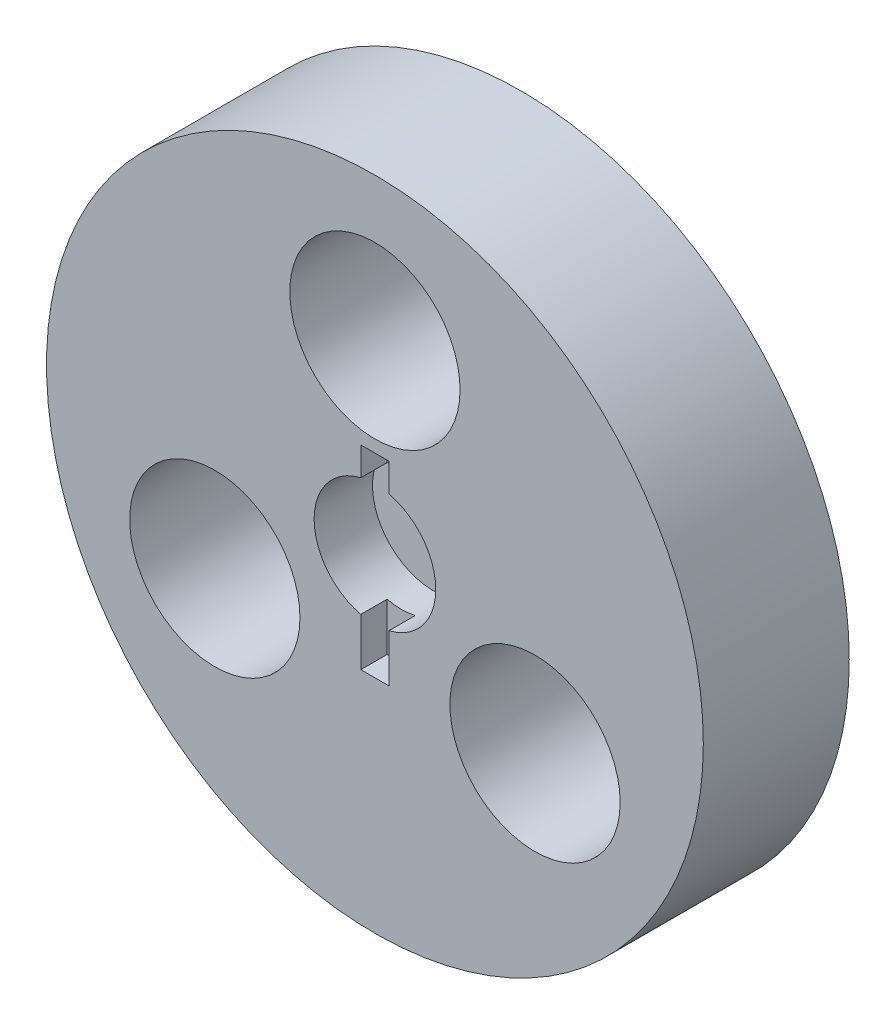
ISO-10303-21;
HEADER;
FILE_DESCRIPTION(('STEP AP214'),'2;1');
FILE_NAME('part.step','',(''),(''),'','','');
FILE_SCHEMA(('AUTOMOTIVE_DESIGN { 1 0 10303 214 1 1 1 1 }'));
ENDSEC;
DATA;
#1=APPLICATION_CONTEXT('core data for automotive mechanical design processes');
#2=APPLICATION_PROTOCOL_DEFINITION('international standard','automotive_design',2000,#1);
#3=PRODUCT_CONTEXT('',#1,'mechanical');
#4=PRODUCT('Part','Part','',(#3));
#5=PRODUCT_RELATED_PRODUCT_CATEGORY('part','',(#4));
#6=PRODUCT_DEFINITION_FORMATION('','',#4);
#7=PRODUCT_DEFINITION_CONTEXT('part definition',#1,'design');
#8=PRODUCT_DEFINITION('design','',#6,#7);
#9=PRODUCT_DEFINITION_SHAPE('','',#8);
#10=(LENGTH_UNIT() NAMED_UNIT(*) SI_UNIT(.MILLI.,.METRE.));
#11=(NAMED_UNIT(*) PLANE_ANGLE_UNIT() SI_UNIT($,.RADIAN.));
#12=(NAMED_UNIT(*) SI_UNIT($,.STERADIAN.) SOLID_ANGLE_UNIT());
#13=UNCERTAINTY_MEASURE_WITH_UNIT(LENGTH_MEASURE(1.E-05),#10,'distance_accuracy_value','');
#14=(GEOMETRIC_REPRESENTATION_CONTEXT(3) GLOBAL_UNCERTAINTY_ASSIGNED_CONTEXT((#13)) GLOBAL_UNIT_ASSIGNED_CONTEXT((#10,
#11,#12)) REPRESENTATION_CONTEXT('',''));
#15=CARTESIAN_POINT('',(0.,0.,0.));
#16=DIRECTION('',(0.,0.,1.));
#17=DIRECTION('',(1.,0.,0.));
#18=AXIS2_PLACEMENT_3D('',#15,#16,#17);
#19=CARTESIAN_POINT('',(0.,24.13,9.525));
#20=DIRECTION('',(0.,0.,-1.));
#21=DIRECTION('',(-1.,0.,0.));
#22=AXIS2_PLACEMENT_3D('',#19,#20,#21);
#23=CYLINDRICAL_SURFACE('',#22,11.1125);
#24=CARTESIAN_POINT('',(0.,24.13,9.525));
#25=DIRECTION('',(0.,0.,1.));
#26=DIRECTION('',(1.,0.,0.));
#27=AXIS2_PLACEMENT_3D('',#24,#25,#26);
#28=CIRCLE('',#27,11.1125);
#29=CARTESIAN_POINT('',(11.1125,24.13,9.525));
#30=VERTEX_POINT('',#29);
#31=EDGE_CURVE('E158',#30,#30,#28,.T.);
#32=ORIENTED_EDGE('',*,*,#31,.T.);
#33=EDGE_LOOP('',(#32));
#34=FACE_BOUND('',#33,.T.);
#35=CARTESIAN_POINT('',(0.,24.13,-9.525));
#36=DIRECTION('',(0.,0.,1.));
#37=DIRECTION('',(1.,0.,0.));
#38=AXIS2_PLACEMENT_3D('',#35,#36,#37);
#39=CIRCLE('',#38,11.1125);
#40=CARTESIAN_POINT('',(11.1125,24.13,-9.525));
#41=VERTEX_POINT('',#40);
#42=EDGE_CURVE('E169',#41,#41,#39,.T.);
#43=ORIENTED_EDGE('',*,*,#42,.F.);
#44=EDGE_LOOP('',(#43));
#45=FACE_BOUND('',#44,.T.);
#46=ADVANCED_FACE('F35',(#34,#45),#23,.F.);
#47=CARTESIAN_POINT('',(-20.8971929933185,-12.065,9.525));
#48=DIRECTION('',(0.,0.,-1.));
#49=DIRECTION('',(-1.,0.,0.));
#50=AXIS2_PLACEMENT_3D('',#47,#48,#49);
#51=CYLINDRICAL_SURFACE('',#50,11.1125);
#52=CARTESIAN_POINT('',(-20.8971929933185,-12.065,9.525));
#53=DIRECTION('',(0.,0.,1.));
#54=DIRECTION('',(1.,0.,0.));
#55=AXIS2_PLACEMENT_3D('',#52,#53,#54);
#56=CIRCLE('',#55,11.1125);
#57=CARTESIAN_POINT('',(-9.78469299331853,-12.065,9.525));
#58=VERTEX_POINT('',#57);
#59=EDGE_CURVE('E154',#58,#58,#56,.T.);
#60=ORIENTED_EDGE('',*,*,#59,.T.);
#61=EDGE_LOOP('',(#60));
#62=FACE_BOUND('',#61,.T.);
#63=CARTESIAN_POINT('',(-20.8971929933185,-12.065,-9.525));
#64=DIRECTION('',(0.,0.,1.));
#65=DIRECTION('',(1.,0.,0.));
#66=AXIS2_PLACEMENT_3D('',#63,#64,#65);
#67=CIRCLE('',#66,11.1125);
#68=CARTESIAN_POINT('',(-9.78469299331853,-12.065,-9.525));
#69=VERTEX_POINT('',#68);
#70=EDGE_CURVE('E166',#69,#69,#67,.T.);
#71=ORIENTED_EDGE('',*,*,#70,.F.);
#72=EDGE_LOOP('',(#71));
#73=FACE_BOUND('',#72,.T.);
#74=ADVANCED_FACE('F220',(#62,#73),#51,.F.);
#75=CARTESIAN_POINT('',(20.8971929933185,-12.0649999999999,9.525));
#76=DIRECTION('',(0.,0.,-1.));
#77=DIRECTION('',(-1.,0.,0.));
#78=AXIS2_PLACEMENT_3D('',#75,#76,#77);
#79=CYLINDRICAL_SURFACE('',#78,11.1125);
#80=CARTESIAN_POINT('',(20.8971929933185,-12.0649999999999,9.525));
#81=DIRECTION('',(0.,0.,1.));
#82=DIRECTION('',(1.,0.,0.));
#83=AXIS2_PLACEMENT_3D('',#80,#81,#82);
#84=CIRCLE('',#83,11.1125);
#85=CARTESIAN_POINT('',(32.0096929933185,-12.0649999999999,9.525));
#86=VERTEX_POINT('',#85);
#87=EDGE_CURVE('E151',#86,#86,#84,.T.);
#88=ORIENTED_EDGE('',*,*,#87,.T.);
#89=EDGE_LOOP('',(#88));
#90=FACE_BOUND('',#89,.T.);
#91=CARTESIAN_POINT('',(20.8971929933185,-12.0649999999999,-9.525));
#92=DIRECTION('',(0.,0.,1.));
#93=DIRECTION('',(1.,0.,0.));
#94=AXIS2_PLACEMENT_3D('',#91,#92,#93);
#95=CIRCLE('',#94,11.1125);
#96=CARTESIAN_POINT('',(32.0096929933185,-12.0649999999999,-9.525));
#97=VERTEX_POINT('',#96);
#98=EDGE_CURVE('E147',#97,#97,#95,.T.);
#99=ORIENTED_EDGE('',*,*,#98,.F.);
#100=EDGE_LOOP('',(#99));
#101=FACE_BOUND('',#100,.T.);
#102=ADVANCED_FACE('F37',(#90,#101),#79,.F.);
#103=CARTESIAN_POINT('',(0.,0.,9.525));
#104=DIRECTION('',(0.,0.,-1.));
#105=DIRECTION('',(-1.,0.,0.));
#106=AXIS2_PLACEMENT_3D('',#103,#104,#105);
#107=CYLINDRICAL_SURFACE('',#106,42.8625);
#108=CARTESIAN_POINT('',(0.,0.,9.525));
#109=DIRECTION('',(0.,0.,1.));
#110=DIRECTION('',(1.,0.,0.));
#111=AXIS2_PLACEMENT_3D('',#108,#109,#110);
#112=CIRCLE('',#111,42.8625);
#113=CARTESIAN_POINT('',(42.8625,0.,9.525));
#114=VERTEX_POINT('',#113);
#115=EDGE_CURVE('E161',#114,#114,#112,.T.);
#116=ORIENTED_EDGE('',*,*,#115,.F.);
#117=EDGE_LOOP('',(#116));
#118=FACE_BOUND('',#117,.T.);
#119=CARTESIAN_POINT('',(0.,0.,-9.525));
#120=DIRECTION('',(0.,0.,1.));
#121=DIRECTION('',(1.,0.,0.));
#122=AXIS2_PLACEMENT_3D('',#119,#120,#121);
#123=CIRCLE('',#122,42.8625);
#124=CARTESIAN_POINT('',(42.8625,0.,-9.525));
#125=VERTEX_POINT('',#124);
#126=EDGE_CURVE('E155',#125,#125,#123,.T.);
#127=ORIENTED_EDGE('',*,*,#126,.T.);
#128=EDGE_LOOP('',(#127));
#129=FACE_BOUND('',#128,.T.);
#130=ADVANCED_FACE('F229',(#118,#129),#107,.T.);
#131=CARTESIAN_POINT('',(0.,0.,9.525));
#132=DIRECTION('',(0.,0.,1.));
#133=DIRECTION('',(1.,0.,0.));
#134=AXIS2_PLACEMENT_3D('',#131,#132,#133);
#135=PLANE('',#134);
#136=DIRECTION('',(0.,1.,0.));
#137=VECTOR('',#136,1.);
#138=CARTESIAN_POINT('',(1.8415,11.43,9.525));
#139=LINE('',#138,#137);
#140=CARTESIAN_POINT('',(1.8415,-13.97,9.525));
#141=VERTEX_POINT('',#140);
#142=CARTESIAN_POINT('',(1.8415,-7.7209315500139,9.525));
#143=VERTEX_POINT('',#142);
#144=EDGE_CURVE('E128',#141,#143,#139,.T.);
#145=ORIENTED_EDGE('',*,*,#144,.F.);
#146=DIRECTION('',(1.,0.,0.));
#147=VECTOR('',#146,1.);
#148=CARTESIAN_POINT('',(1.8415,-13.97,9.525));
#149=LINE('',#148,#147);
#150=CARTESIAN_POINT('',(-1.8415,-13.97,9.525));
#151=VERTEX_POINT('',#150);
#152=EDGE_CURVE('E109',#151,#141,#149,.T.);
#153=ORIENTED_EDGE('',*,*,#152,.F.);
#154=DIRECTION('',(0.,-1.,0.));
#155=VECTOR('',#154,1.);
#156=CARTESIAN_POINT('',(-1.8415,11.43,9.525));
#157=LINE('',#156,#155);
#158=CARTESIAN_POINT('',(-1.8415,-7.7209315500139,9.525));
#159=VERTEX_POINT('',#158);
#160=EDGE_CURVE('E132',#159,#151,#157,.T.);
#161=ORIENTED_EDGE('',*,*,#160,.F.);
#162=CARTESIAN_POINT('',(0.,0.,9.525));
#163=DIRECTION('',(0.,0.,1.));
#164=DIRECTION('',(1.,0.,0.));
#165=AXIS2_PLACEMENT_3D('',#162,#163,#164);
#166=CIRCLE('',#165,7.9375);
#167=CARTESIAN_POINT('',(-1.8415,7.7209315500139,9.525));
#168=VERTEX_POINT('',#167);
#169=EDGE_CURVE('E148',#168,#159,#166,.T.);
#170=ORIENTED_EDGE('',*,*,#169,.F.);
#171=CARTESIAN_POINT('',(-1.8415,11.43,9.525));
#172=VERTEX_POINT('',#171);
#173=EDGE_CURVE('E133',#172,#168,#157,.T.);
#174=ORIENTED_EDGE('',*,*,#173,.F.);
#175=DIRECTION('',(-1.,0.,0.));
#176=VECTOR('',#175,1.);
#177=CARTESIAN_POINT('',(1.8415,11.43,9.525));
#178=LINE('',#177,#176);
#179=CARTESIAN_POINT('',(1.8415,11.43,9.525));
#180=VERTEX_POINT('',#179);
#181=EDGE_CURVE('E130',#180,#172,#178,.T.);
#182=ORIENTED_EDGE('',*,*,#181,.F.);
#183=CARTESIAN_POINT('',(1.8415,7.7209315500139,9.525));
#184=VERTEX_POINT('',#183);
#185=EDGE_CURVE('E115',#184,#180,#139,.T.);
#186=ORIENTED_EDGE('',*,*,#185,.F.);
#187=EDGE_CURVE('E139',#143,#184,#166,.T.);
#188=ORIENTED_EDGE('',*,*,#187,.F.);
#189=EDGE_LOOP('',(#145,#153,#161,#170,#174,#182,#186,#188));
#190=FACE_BOUND('',#189,.T.);
#191=ORIENTED_EDGE('',*,*,#87,.F.);
#192=EDGE_LOOP('',(#191));
#193=FACE_BOUND('',#192,.T.);
#194=ORIENTED_EDGE('',*,*,#59,.F.);
#195=EDGE_LOOP('',(#194));
#196=FACE_BOUND('',#195,.T.);
#197=ORIENTED_EDGE('',*,*,#31,.F.);
#198=EDGE_LOOP('',(#197));
#199=FACE_BOUND('',#198,.T.);
#200=ORIENTED_EDGE('',*,*,#115,.T.);
#201=EDGE_LOOP('',(#200));
#202=FACE_BOUND('',#201,.T.);
#203=ADVANCED_FACE('F201',(#190,#193,#196,#199,#202),#135,.T.);
#204=CARTESIAN_POINT('',(0.,0.,-9.525));
#205=DIRECTION('',(0.,0.,1.));
#206=DIRECTION('',(1.,0.,0.));
#207=AXIS2_PLACEMENT_3D('',#204,#205,#206);
#208=PLANE('',#207);
#209=ORIENTED_EDGE('',*,*,#98,.T.);
#210=EDGE_LOOP('',(#209));
#211=FACE_BOUND('',#210,.T.);
#212=ORIENTED_EDGE('',*,*,#70,.T.);
#213=EDGE_LOOP('',(#212));
#214=FACE_BOUND('',#213,.T.);
#215=ORIENTED_EDGE('',*,*,#42,.T.);
#216=EDGE_LOOP('',(#215));
#217=FACE_BOUND('',#216,.T.);
#218=ORIENTED_EDGE('',*,*,#126,.F.);
#219=EDGE_LOOP('',(#218));
#220=FACE_BOUND('',#219,.T.);
#221=ADVANCED_FACE('F233',(#211,#214,#217,#220),#208,.F.);
#222=CARTESIAN_POINT('',(0.,0.,1.905));
#223=DIRECTION('',(0.,0.,1.));
#224=DIRECTION('',(1.,0.,0.));
#225=AXIS2_PLACEMENT_3D('',#222,#223,#224);
#226=CYLINDRICAL_SURFACE('',#225,7.9375);
#227=CARTESIAN_POINT('',(0.,0.,6.096));
#228=DIRECTION('',(0.,0.,-1.));
#229=DIRECTION('',(-1.,0.,0.));
#230=AXIS2_PLACEMENT_3D('',#227,#228,#229);
#231=CIRCLE('',#230,7.9375);
#232=CARTESIAN_POINT('',(-1.8415,-7.7209315500139,6.096));
#233=VERTEX_POINT('',#232);
#234=CARTESIAN_POINT('',(1.8415,-7.7209315500139,6.096));
#235=VERTEX_POINT('',#234);
#236=EDGE_CURVE('E176',#233,#235,#231,.F.);
#237=ORIENTED_EDGE('',*,*,#236,.T.);
#238=DIRECTION('',(0.,0.,1.));
#239=VECTOR('',#238,1.);
#240=CARTESIAN_POINT('',(1.8415,-7.7209315500139,1.905));
#241=LINE('',#240,#239);
#242=EDGE_CURVE('E11',#235,#143,#241,.T.);
#243=ORIENTED_EDGE('',*,*,#242,.T.);
#244=ORIENTED_EDGE('',*,*,#187,.T.);
#245=DIRECTION('',(0.,0.,1.));
#246=VECTOR('',#245,1.);
#247=CARTESIAN_POINT('',(1.8415,7.7209315500139,1.905));
#248=LINE('',#247,#246);
#249=CARTESIAN_POINT('',(1.8415,7.7209315500139,6.096));
#250=VERTEX_POINT('',#249);
#251=EDGE_CURVE('E179',#184,#250,#248,.F.);
#252=ORIENTED_EDGE('',*,*,#251,.T.);
#253=CARTESIAN_POINT('',(-1.8415,7.7209315500139,6.096));
#254=VERTEX_POINT('',#253);
#255=EDGE_CURVE('E106',#250,#254,#231,.F.);
#256=ORIENTED_EDGE('',*,*,#255,.T.);
#257=DIRECTION('',(0.,0.,1.));
#258=VECTOR('',#257,1.);
#259=CARTESIAN_POINT('',(-1.8415,7.7209315500139,1.905));
#260=LINE('',#259,#258);
#261=EDGE_CURVE('E175',#254,#168,#260,.T.);
#262=ORIENTED_EDGE('',*,*,#261,.T.);
#263=ORIENTED_EDGE('',*,*,#169,.T.);
#264=DIRECTION('',(0.,0.,1.));
#265=VECTOR('',#264,1.);
#266=CARTESIAN_POINT('',(-1.8415,-7.7209315500139,1.905));
#267=LINE('',#266,#265);
#268=EDGE_CURVE('E43',#159,#233,#267,.F.);
#269=ORIENTED_EDGE('',*,*,#268,.T.);
#270=EDGE_LOOP('',(#237,#243,#244,#252,#256,#262,#263,#269));
#271=FACE_BOUND('',#270,.T.);
#272=CARTESIAN_POINT('',(0.,0.,1.905));
#273=DIRECTION('',(0.,0.,1.));
#274=DIRECTION('',(1.,0.,0.));
#275=AXIS2_PLACEMENT_3D('',#272,#273,#274);
#276=CIRCLE('',#275,7.9375);
#277=CARTESIAN_POINT('',(7.9375,0.,1.905));
#278=VERTEX_POINT('',#277);
#279=EDGE_CURVE('E144',#278,#278,#276,.T.);
#280=ORIENTED_EDGE('',*,*,#279,.F.);
#281=EDGE_LOOP('',(#280));
#282=FACE_BOUND('',#281,.T.);
#283=ADVANCED_FACE('F184',(#271,#282),#226,.F.);
#284=CARTESIAN_POINT('',(0.,0.,1.905));
#285=DIRECTION('',(0.,0.,1.));
#286=DIRECTION('',(1.,0.,0.));
#287=AXIS2_PLACEMENT_3D('',#284,#285,#286);
#288=PLANE('',#287);
#289=ORIENTED_EDGE('',*,*,#279,.T.);
#290=EDGE_LOOP('',(#289));
#291=FACE_BOUND('',#290,.T.);
#292=ADVANCED_FACE('F214',(#291),#288,.T.);
#293=CARTESIAN_POINT('',(0.,0.,6.096));
#294=DIRECTION('',(0.,0.,-1.));
#295=DIRECTION('',(-1.,0.,0.));
#296=AXIS2_PLACEMENT_3D('',#293,#294,#295);
#297=PLANE('',#296);
#298=DIRECTION('',(0.,1.,0.));
#299=VECTOR('',#298,1.);
#300=CARTESIAN_POINT('',(1.8415,11.43,6.096));
#301=LINE('',#300,#299);
#302=CARTESIAN_POINT('',(1.8415,11.43,6.096));
#303=VERTEX_POINT('',#302);
#304=EDGE_CURVE('E100',#250,#303,#301,.T.);
#305=ORIENTED_EDGE('',*,*,#304,.T.);
#306=DIRECTION('',(-1.,0.,0.));
#307=VECTOR('',#306,1.);
#308=CARTESIAN_POINT('',(1.8415,11.43,6.096));
#309=LINE('',#308,#307);
#310=CARTESIAN_POINT('',(-1.8415,11.43,6.096));
#311=VERTEX_POINT('',#310);
#312=EDGE_CURVE('E104',#303,#311,#309,.T.);
#313=ORIENTED_EDGE('',*,*,#312,.T.);
#314=DIRECTION('',(0.,-1.,0.));
#315=VECTOR('',#314,1.);
#316=CARTESIAN_POINT('',(-1.8415,11.43,6.096));
#317=LINE('',#316,#315);
#318=EDGE_CURVE('E58',#311,#254,#317,.T.);
#319=ORIENTED_EDGE('',*,*,#318,.T.);
#320=ORIENTED_EDGE('',*,*,#255,.F.);
#321=EDGE_LOOP('',(#305,#313,#319,#320));
#322=FACE_BOUND('',#321,.T.);
#323=ADVANCED_FACE('F102',(#322),#297,.F.);
#324=CARTESIAN_POINT('',(-1.8415,11.43,6.096));
#325=DIRECTION('',(-1.,0.,0.));
#326=DIRECTION('',(0.,-1.,0.));
#327=AXIS2_PLACEMENT_3D('',#324,#325,#326);
#328=PLANE('',#327);
#329=ORIENTED_EDGE('',*,*,#318,.F.);
#330=DIRECTION('',(0.,0.,1.));
#331=VECTOR('',#330,1.);
#332=CARTESIAN_POINT('',(-1.8415,11.43,6.096));
#333=LINE('',#332,#331);
#334=EDGE_CURVE('E119',#311,#172,#333,.T.);
#335=ORIENTED_EDGE('',*,*,#334,.T.);
#336=ORIENTED_EDGE('',*,*,#173,.T.);
#337=ORIENTED_EDGE('',*,*,#261,.F.);
#338=EDGE_LOOP('',(#329,#335,#336,#337));
#339=FACE_BOUND('',#338,.T.);
#340=ADVANCED_FACE('F206',(#339),#328,.F.);
#341=CARTESIAN_POINT('',(1.8415,11.43,6.096));
#342=DIRECTION('',(1.,0.,0.));
#343=DIRECTION('',(0.,1.,0.));
#344=AXIS2_PLACEMENT_3D('',#341,#342,#343);
#345=PLANE('',#344);
#346=ORIENTED_EDGE('',*,*,#185,.T.);
#347=DIRECTION('',(0.,0.,1.));
#348=VECTOR('',#347,1.);
#349=CARTESIAN_POINT('',(1.8415,11.43,6.096));
#350=LINE('',#349,#348);
#351=EDGE_CURVE('E112',#303,#180,#350,.T.);
#352=ORIENTED_EDGE('',*,*,#351,.F.);
#353=ORIENTED_EDGE('',*,*,#304,.F.);
#354=ORIENTED_EDGE('',*,*,#251,.F.);
#355=EDGE_LOOP('',(#346,#352,#353,#354));
#356=FACE_BOUND('',#355,.T.);
#357=ADVANCED_FACE('F113',(#356),#345,.F.);
#358=CARTESIAN_POINT('',(1.8415,11.43,6.096));
#359=DIRECTION('',(0.,1.,0.));
#360=DIRECTION('',(0.,0.,1.));
#361=AXIS2_PLACEMENT_3D('',#358,#359,#360);
#362=PLANE('',#361);
#363=ORIENTED_EDGE('',*,*,#181,.T.);
#364=ORIENTED_EDGE('',*,*,#334,.F.);
#365=ORIENTED_EDGE('',*,*,#312,.F.);
#366=ORIENTED_EDGE('',*,*,#351,.T.);
#367=EDGE_LOOP('',(#363,#364,#365,#366));
#368=FACE_BOUND('',#367,.T.);
#369=ADVANCED_FACE('F122',(#368),#362,.F.);
#370=CARTESIAN_POINT('',(1.8415,-13.97,6.096));
#371=VERTEX_POINT('',#370);
#372=EDGE_CURVE('E50',#371,#235,#301,.T.);
#373=ORIENTED_EDGE('',*,*,#372,.F.);
#374=DIRECTION('',(0.,0.,1.));
#375=VECTOR('',#374,1.);
#376=CARTESIAN_POINT('',(1.8415,-13.97,6.096));
#377=LINE('',#376,#375);
#378=EDGE_CURVE('E137',#371,#141,#377,.T.);
#379=ORIENTED_EDGE('',*,*,#378,.T.);
#380=ORIENTED_EDGE('',*,*,#144,.T.);
#381=ORIENTED_EDGE('',*,*,#242,.F.);
#382=EDGE_LOOP('',(#373,#379,#380,#381));
#383=FACE_BOUND('',#382,.T.);
#384=ADVANCED_FACE('F199',(#383),#345,.F.);
#385=ORIENTED_EDGE('',*,*,#160,.T.);
#386=DIRECTION('',(0.,0.,1.));
#387=VECTOR('',#386,1.);
#388=CARTESIAN_POINT('',(-1.8415,-13.97,6.096));
#389=LINE('',#388,#387);
#390=CARTESIAN_POINT('',(-1.8415,-13.97,6.096));
#391=VERTEX_POINT('',#390);
#392=EDGE_CURVE('E140',#391,#151,#389,.T.);
#393=ORIENTED_EDGE('',*,*,#392,.F.);
#394=EDGE_CURVE('E123',#233,#391,#317,.T.);
#395=ORIENTED_EDGE('',*,*,#394,.F.);
#396=ORIENTED_EDGE('',*,*,#268,.F.);
#397=EDGE_LOOP('',(#385,#393,#395,#396));
#398=FACE_BOUND('',#397,.T.);
#399=ADVANCED_FACE('F191',(#398),#328,.F.);
#400=ORIENTED_EDGE('',*,*,#394,.T.);
#401=DIRECTION('',(1.,0.,0.));
#402=VECTOR('',#401,1.);
#403=CARTESIAN_POINT('',(1.8415,-13.97,6.096));
#404=LINE('',#403,#402);
#405=EDGE_CURVE('E120',#391,#371,#404,.T.);
#406=ORIENTED_EDGE('',*,*,#405,.T.);
#407=ORIENTED_EDGE('',*,*,#372,.T.);
#408=ORIENTED_EDGE('',*,*,#236,.F.);
#409=EDGE_LOOP('',(#400,#406,#407,#408));
#410=FACE_BOUND('',#409,.T.);
#411=ADVANCED_FACE('F188',(#410),#297,.F.);
#412=CARTESIAN_POINT('',(1.8415,-13.97,6.096));
#413=DIRECTION('',(0.,-1.,0.));
#414=DIRECTION('',(0.,0.,-1.));
#415=AXIS2_PLACEMENT_3D('',#412,#413,#414);
#416=PLANE('',#415);
#417=ORIENTED_EDGE('',*,*,#152,.T.);
#418=ORIENTED_EDGE('',*,*,#378,.F.);
#419=ORIENTED_EDGE('',*,*,#405,.F.);
#420=ORIENTED_EDGE('',*,*,#392,.T.);
#421=EDGE_LOOP('',(#417,#418,#419,#420));
#422=FACE_BOUND('',#421,.T.);
#423=ADVANCED_FACE('F196',(#422),#416,.F.);
#424=CLOSED_SHELL('',(#46,#74,#102,#130,#203,#221,#283,#292,#323,#340,#357,#369,#384,#399,#411,#423));
#425=MANIFOLD_SOLID_BREP('B2',#424);
#426=ADVANCED_BREP_SHAPE_REPRESENTATION('',(#18,#425),#14);
#427=SHAPE_DEFINITION_REPRESENTATION(#9,#426);
ENDSEC;
END-ISO-10303-21;
